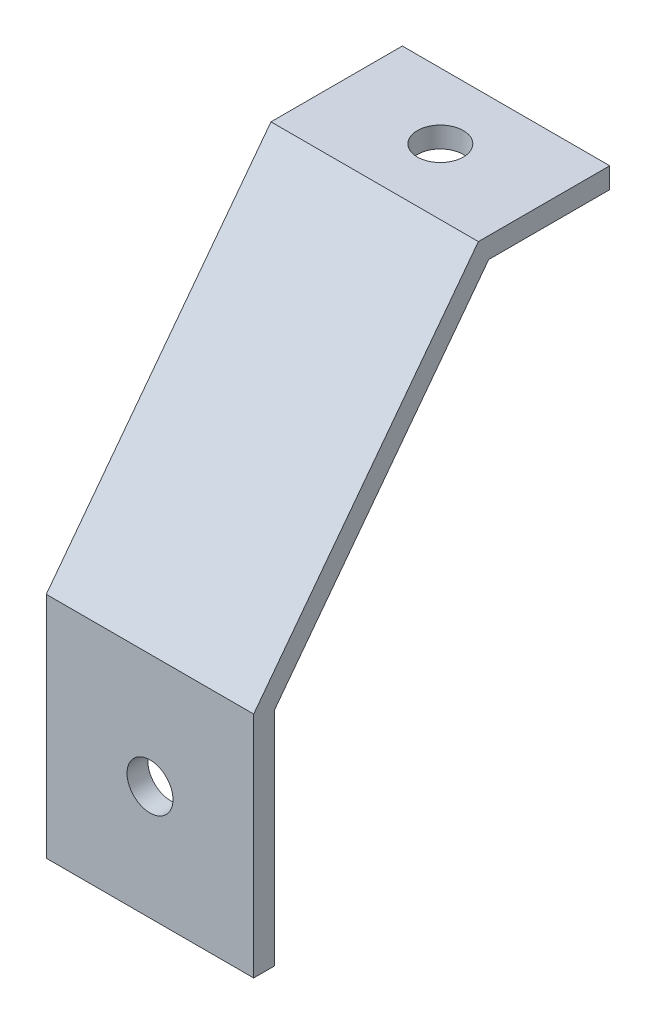
ISO-10303-21;
HEADER;
FILE_DESCRIPTION(('STEP AP214'),'2;1');
FILE_NAME('part.step','',(''),(''),'','','');
FILE_SCHEMA(('AUTOMOTIVE_DESIGN { 1 0 10303 214 1 1 1 1 }'));
ENDSEC;
DATA;
#1=APPLICATION_CONTEXT('core data for automotive mechanical design processes');
#2=APPLICATION_PROTOCOL_DEFINITION('international standard','automotive_design',2000,#1);
#3=PRODUCT_CONTEXT('',#1,'mechanical');
#4=PRODUCT('Part','Part','',(#3));
#5=PRODUCT_RELATED_PRODUCT_CATEGORY('part','',(#4));
#6=PRODUCT_DEFINITION_FORMATION('','',#4);
#7=PRODUCT_DEFINITION_CONTEXT('part definition',#1,'design');
#8=PRODUCT_DEFINITION('design','',#6,#7);
#9=PRODUCT_DEFINITION_SHAPE('','',#8);
#10=(LENGTH_UNIT() NAMED_UNIT(*) SI_UNIT(.MILLI.,.METRE.));
#11=(NAMED_UNIT(*) PLANE_ANGLE_UNIT() SI_UNIT($,.RADIAN.));
#12=(NAMED_UNIT(*) SI_UNIT($,.STERADIAN.) SOLID_ANGLE_UNIT());
#13=UNCERTAINTY_MEASURE_WITH_UNIT(LENGTH_MEASURE(1.E-05),#10,'distance_accuracy_value','');
#14=(GEOMETRIC_REPRESENTATION_CONTEXT(3) GLOBAL_UNCERTAINTY_ASSIGNED_CONTEXT((#13)) GLOBAL_UNIT_ASSIGNED_CONTEXT((#10,
#11,#12)) REPRESENTATION_CONTEXT('',''));
#15=CARTESIAN_POINT('',(0.,0.,0.));
#16=DIRECTION('',(0.,0.,1.));
#17=DIRECTION('',(1.,0.,0.));
#18=AXIS2_PLACEMENT_3D('',#15,#16,#17);
#19=CARTESIAN_POINT('',(0.,68.1228485595605,-32.4549046787092));
#20=DIRECTION('',(1.,0.,0.));
#21=DIRECTION('',(0.,1.,0.));
#22=AXIS2_PLACEMENT_3D('',#19,#20,#21);
#23=PLANE('',#22);
#24=DIRECTION('',(0.,-0.797315565072254,0.603562664264045));
#25=VECTOR('',#24,1.);
#26=CARTESIAN_POINT('',(0.,76.,-32.5));
#27=LINE('',#26,#25);
#28=CARTESIAN_POINT('',(0.,76.,-32.5));
#29=VERTEX_POINT('',#28);
#30=CARTESIAN_POINT('',(0.,33.067,0.));
#31=VERTEX_POINT('',#30);
#32=EDGE_CURVE('E27',#29,#31,#27,.T.);
#33=ORIENTED_EDGE('',*,*,#32,.F.);
#34=DIRECTION('',(0.,0.,1.));
#35=VECTOR('',#34,1.);
#36=CARTESIAN_POINT('',(0.,76.,-51.5));
#37=LINE('',#36,#35);
#38=CARTESIAN_POINT('',(0.,76.,-51.5));
#39=VERTEX_POINT('',#38);
#40=EDGE_CURVE('E149',#39,#29,#37,.T.);
#41=ORIENTED_EDGE('',*,*,#40,.F.);
#42=DIRECTION('',(0.,1.,0.));
#43=VECTOR('',#42,1.);
#44=CARTESIAN_POINT('',(0.,73.,-51.5));
#45=LINE('',#44,#43);
#46=CARTESIAN_POINT('',(0.,73.,-51.5));
#47=VERTEX_POINT('',#46);
#48=EDGE_CURVE('E191',#47,#39,#45,.T.);
#49=ORIENTED_EDGE('',*,*,#48,.F.);
#50=DIRECTION('',(0.,0.,-1.));
#51=VECTOR('',#50,1.);
#52=CARTESIAN_POINT('',(0.,73.,-33.9916452899049));
#53=LINE('',#52,#51);
#54=CARTESIAN_POINT('',(0.,73.,-33.9916452899049));
#55=VERTEX_POINT('',#54);
#56=EDGE_CURVE('E125',#55,#47,#53,.T.);
#57=ORIENTED_EDGE('',*,*,#56,.F.);
#58=DIRECTION('',(0.,0.797315565072254,-0.603562664264045));
#59=VECTOR('',#58,1.);
#60=CARTESIAN_POINT('',(0.,32.1031339039512,-3.03298532853283));
#61=LINE('',#60,#59);
#62=CARTESIAN_POINT('',(0.,32.1031339039512,-3.03298532853283));
#63=VERTEX_POINT('',#62);
#64=EDGE_CURVE('E20',#63,#55,#61,.T.);
#65=ORIENTED_EDGE('',*,*,#64,.F.);
#66=DIRECTION('',(0.,0.999999472142826,-0.00102747947349856));
#67=VECTOR('',#66,1.);
#68=CARTESIAN_POINT('',(0.,0.,-3.));
#69=LINE('',#68,#67);
#70=CARTESIAN_POINT('',(0.,0.,-3.));
#71=VERTEX_POINT('',#70);
#72=EDGE_CURVE('E129',#71,#63,#69,.T.);
#73=ORIENTED_EDGE('',*,*,#72,.F.);
#74=DIRECTION('',(0.,0.,-1.));
#75=VECTOR('',#74,1.);
#76=CARTESIAN_POINT('',(0.,0.,0.));
#77=LINE('',#76,#75);
#78=CARTESIAN_POINT('',(0.,0.,0.));
#79=VERTEX_POINT('',#78);
#80=EDGE_CURVE('E98',#79,#71,#77,.T.);
#81=ORIENTED_EDGE('',*,*,#80,.F.);
#82=DIRECTION('',(0.,-1.,0.));
#83=VECTOR('',#82,1.);
#84=CARTESIAN_POINT('',(0.,33.067,0.));
#85=LINE('',#84,#83);
#86=EDGE_CURVE('E134',#31,#79,#85,.T.);
#87=ORIENTED_EDGE('',*,*,#86,.F.);
#88=EDGE_LOOP('',(#33,#41,#49,#57,#65,#73,#81,#87));
#89=FACE_BOUND('',#88,.T.);
#90=ADVANCED_FACE('F16',(#89),#23,.F.);
#91=CARTESIAN_POINT('',(30.,68.1228485595605,-32.4549046787092));
#92=DIRECTION('',(1.,0.,0.));
#93=DIRECTION('',(0.,1.,0.));
#94=AXIS2_PLACEMENT_3D('',#91,#92,#93);
#95=PLANE('',#94);
#96=DIRECTION('',(0.,-0.797315565072254,0.603562664264045));
#97=VECTOR('',#96,1.);
#98=CARTESIAN_POINT('',(30.,76.,-32.5));
#99=LINE('',#98,#97);
#100=CARTESIAN_POINT('',(30.,76.,-32.5));
#101=VERTEX_POINT('',#100);
#102=CARTESIAN_POINT('',(30.,33.067,0.));
#103=VERTEX_POINT('',#102);
#104=EDGE_CURVE('E11',#101,#103,#99,.T.);
#105=ORIENTED_EDGE('',*,*,#104,.T.);
#106=DIRECTION('',(0.,-1.,0.));
#107=VECTOR('',#106,1.);
#108=CARTESIAN_POINT('',(30.,33.067,0.));
#109=LINE('',#108,#107);
#110=CARTESIAN_POINT('',(30.,0.,0.));
#111=VERTEX_POINT('',#110);
#112=EDGE_CURVE('E130',#103,#111,#109,.T.);
#113=ORIENTED_EDGE('',*,*,#112,.T.);
#114=DIRECTION('',(0.,0.,-1.));
#115=VECTOR('',#114,1.);
#116=CARTESIAN_POINT('',(30.,0.,0.));
#117=LINE('',#116,#115);
#118=CARTESIAN_POINT('',(30.,0.,-3.));
#119=VERTEX_POINT('',#118);
#120=EDGE_CURVE('E152',#111,#119,#117,.T.);
#121=ORIENTED_EDGE('',*,*,#120,.T.);
#122=DIRECTION('',(0.,0.999999472142826,-0.00102747947349856));
#123=VECTOR('',#122,1.);
#124=CARTESIAN_POINT('',(30.,0.,-3.));
#125=LINE('',#124,#123);
#126=CARTESIAN_POINT('',(30.,32.1031339039512,-3.03298532853283));
#127=VERTEX_POINT('',#126);
#128=EDGE_CURVE('E139',#119,#127,#125,.T.);
#129=ORIENTED_EDGE('',*,*,#128,.T.);
#130=DIRECTION('',(0.,0.797315565072254,-0.603562664264045));
#131=VECTOR('',#130,1.);
#132=CARTESIAN_POINT('',(30.,32.1031339039512,-3.03298532853283));
#133=LINE('',#132,#131);
#134=CARTESIAN_POINT('',(30.,73.,-33.9916452899049));
#135=VERTEX_POINT('',#134);
#136=EDGE_CURVE('E41',#127,#135,#133,.T.);
#137=ORIENTED_EDGE('',*,*,#136,.T.);
#138=DIRECTION('',(0.,0.,-1.));
#139=VECTOR('',#138,1.);
#140=CARTESIAN_POINT('',(30.,73.,-33.9916452899049));
#141=LINE('',#140,#139);
#142=CARTESIAN_POINT('',(30.,73.,-51.5));
#143=VERTEX_POINT('',#142);
#144=EDGE_CURVE('E138',#135,#143,#141,.T.);
#145=ORIENTED_EDGE('',*,*,#144,.T.);
#146=DIRECTION('',(0.,1.,0.));
#147=VECTOR('',#146,1.);
#148=CARTESIAN_POINT('',(30.,73.,-51.5));
#149=LINE('',#148,#147);
#150=CARTESIAN_POINT('',(30.,76.,-51.5));
#151=VERTEX_POINT('',#150);
#152=EDGE_CURVE('E164',#143,#151,#149,.T.);
#153=ORIENTED_EDGE('',*,*,#152,.T.);
#154=DIRECTION('',(0.,0.,1.));
#155=VECTOR('',#154,1.);
#156=CARTESIAN_POINT('',(30.,76.,-51.5));
#157=LINE('',#156,#155);
#158=EDGE_CURVE('E148',#151,#101,#157,.T.);
#159=ORIENTED_EDGE('',*,*,#158,.T.);
#160=EDGE_LOOP('',(#105,#113,#121,#129,#137,#145,#153,#159));
#161=FACE_BOUND('',#160,.T.);
#162=ADVANCED_FACE('F237',(#161),#95,.T.);
#163=CARTESIAN_POINT('',(0.,76.,-32.5));
#164=DIRECTION('',(0.,0.603562664264045,0.797315565072254));
#165=DIRECTION('',(1.,0.,0.));
#166=AXIS2_PLACEMENT_3D('',#163,#164,#165);
#167=PLANE('',#166);
#168=ORIENTED_EDGE('',*,*,#32,.T.);
#169=DIRECTION('',(1.,0.,0.));
#170=VECTOR('',#169,1.);
#171=CARTESIAN_POINT('',(0.,33.067,0.));
#172=LINE('',#171,#170);
#173=EDGE_CURVE('E126',#31,#103,#172,.T.);
#174=ORIENTED_EDGE('',*,*,#173,.T.);
#175=ORIENTED_EDGE('',*,*,#104,.F.);
#176=DIRECTION('',(1.,0.,0.));
#177=VECTOR('',#176,1.);
#178=CARTESIAN_POINT('',(0.,76.,-32.5));
#179=LINE('',#178,#177);
#180=EDGE_CURVE('E144',#29,#101,#179,.T.);
#181=ORIENTED_EDGE('',*,*,#180,.F.);
#182=EDGE_LOOP('',(#168,#174,#175,#181));
#183=FACE_BOUND('',#182,.T.);
#184=ADVANCED_FACE('F224',(#183),#167,.T.);
#185=CARTESIAN_POINT('',(0.,52.7228120072079,-18.6419466952168));
#186=DIRECTION('',(0.,-0.603562664264045,-0.797315565072254));
#187=DIRECTION('',(0.,-0.797315565072254,0.603562664264045));
#188=AXIS2_PLACEMENT_3D('',#185,#186,#187);
#189=PLANE('',#188);
#190=ORIENTED_EDGE('',*,*,#64,.T.);
#191=DIRECTION('',(1.,0.,0.));
#192=VECTOR('',#191,1.);
#193=CARTESIAN_POINT('',(0.,73.,-33.9916452899049));
#194=LINE('',#193,#192);
#195=EDGE_CURVE('E135',#55,#135,#194,.T.);
#196=ORIENTED_EDGE('',*,*,#195,.T.);
#197=ORIENTED_EDGE('',*,*,#136,.F.);
#198=DIRECTION('',(1.,0.,0.));
#199=VECTOR('',#198,1.);
#200=CARTESIAN_POINT('',(0.,32.1031339039512,-3.03298532853283));
#201=LINE('',#200,#199);
#202=EDGE_CURVE('E143',#63,#127,#201,.T.);
#203=ORIENTED_EDGE('',*,*,#202,.F.);
#204=EDGE_LOOP('',(#190,#196,#197,#203));
#205=FACE_BOUND('',#204,.T.);
#206=ADVANCED_FACE('F244',(#205),#189,.T.);
#207=CARTESIAN_POINT('',(0.,73.,-33.9916452899049));
#208=DIRECTION('',(0.,-1.,0.));
#209=DIRECTION('',(0.,0.,-1.));
#210=AXIS2_PLACEMENT_3D('',#207,#208,#209);
#211=PLANE('',#210);
#212=ORIENTED_EDGE('',*,*,#56,.T.);
#213=DIRECTION('',(1.,0.,0.));
#214=VECTOR('',#213,1.);
#215=CARTESIAN_POINT('',(0.,73.,-51.5));
#216=LINE('',#215,#214);
#217=EDGE_CURVE('E160',#47,#143,#216,.T.);
#218=ORIENTED_EDGE('',*,*,#217,.T.);
#219=ORIENTED_EDGE('',*,*,#144,.F.);
#220=ORIENTED_EDGE('',*,*,#195,.F.);
#221=EDGE_LOOP('',(#212,#218,#219,#220));
#222=FACE_BOUND('',#221,.T.);
#223=CARTESIAN_POINT('',(15.,73.,-42.));
#224=DIRECTION('',(0.,1.,0.));
#225=DIRECTION('',(-1.,0.,0.));
#226=AXIS2_PLACEMENT_3D('',#223,#224,#225);
#227=CIRCLE('',#226,3.3235);
#228=CARTESIAN_POINT('',(18.3235,73.,-42.));
#229=VERTEX_POINT('',#228);
#230=EDGE_CURVE('E113',#229,#229,#227,.T.);
#231=ORIENTED_EDGE('',*,*,#230,.T.);
#232=EDGE_LOOP('',(#231));
#233=FACE_BOUND('',#232,.T.);
#234=ADVANCED_FACE('F18',(#222,#233),#211,.T.);
#235=CARTESIAN_POINT('',(0.,73.,-51.5));
#236=DIRECTION('',(0.,0.,-1.));
#237=DIRECTION('',(0.,-1.,0.));
#238=AXIS2_PLACEMENT_3D('',#235,#236,#237);
#239=PLANE('',#238);
#240=ORIENTED_EDGE('',*,*,#48,.T.);
#241=DIRECTION('',(1.,0.,0.));
#242=VECTOR('',#241,1.);
#243=CARTESIAN_POINT('',(0.,76.,-51.5));
#244=LINE('',#243,#242);
#245=EDGE_CURVE('E173',#39,#151,#244,.T.);
#246=ORIENTED_EDGE('',*,*,#245,.T.);
#247=ORIENTED_EDGE('',*,*,#152,.F.);
#248=ORIENTED_EDGE('',*,*,#217,.F.);
#249=EDGE_LOOP('',(#240,#246,#247,#248));
#250=FACE_BOUND('',#249,.T.);
#251=ADVANCED_FACE('F206',(#250),#239,.T.);
#252=CARTESIAN_POINT('',(0.,76.,-51.5));
#253=DIRECTION('',(0.,1.,0.));
#254=DIRECTION('',(1.,0.,0.));
#255=AXIS2_PLACEMENT_3D('',#252,#253,#254);
#256=PLANE('',#255);
#257=ORIENTED_EDGE('',*,*,#40,.T.);
#258=ORIENTED_EDGE('',*,*,#180,.T.);
#259=ORIENTED_EDGE('',*,*,#158,.F.);
#260=ORIENTED_EDGE('',*,*,#245,.F.);
#261=EDGE_LOOP('',(#257,#258,#259,#260));
#262=FACE_BOUND('',#261,.T.);
#263=CARTESIAN_POINT('',(15.,76.,-42.));
#264=DIRECTION('',(0.,-1.,0.));
#265=DIRECTION('',(-1.,0.,0.));
#266=AXIS2_PLACEMENT_3D('',#263,#264,#265);
#267=CIRCLE('',#266,3.3235);
#268=CARTESIAN_POINT('',(11.6765,76.,-42.));
#269=VERTEX_POINT('',#268);
#270=EDGE_CURVE('E108',#269,#269,#267,.T.);
#271=ORIENTED_EDGE('',*,*,#270,.T.);
#272=EDGE_LOOP('',(#271));
#273=FACE_BOUND('',#272,.T.);
#274=ADVANCED_FACE('F216',(#262,#273),#256,.T.);
#275=CARTESIAN_POINT('',(0.,0.,0.));
#276=DIRECTION('',(0.,-1.,0.));
#277=DIRECTION('',(0.,0.,-1.));
#278=AXIS2_PLACEMENT_3D('',#275,#276,#277);
#279=PLANE('',#278);
#280=ORIENTED_EDGE('',*,*,#80,.T.);
#281=DIRECTION('',(1.,0.,0.));
#282=VECTOR('',#281,1.);
#283=CARTESIAN_POINT('',(0.,0.,-3.));
#284=LINE('',#283,#282);
#285=EDGE_CURVE('E142',#71,#119,#284,.T.);
#286=ORIENTED_EDGE('',*,*,#285,.T.);
#287=ORIENTED_EDGE('',*,*,#120,.F.);
#288=DIRECTION('',(1.,0.,0.));
#289=VECTOR('',#288,1.);
#290=CARTESIAN_POINT('',(0.,0.,0.));
#291=LINE('',#290,#289);
#292=EDGE_CURVE('E167',#79,#111,#291,.T.);
#293=ORIENTED_EDGE('',*,*,#292,.F.);
#294=EDGE_LOOP('',(#280,#286,#287,#293));
#295=FACE_BOUND('',#294,.T.);
#296=ADVANCED_FACE('F232',(#295),#279,.T.);
#297=CARTESIAN_POINT('',(0.,0.,-3.));
#298=DIRECTION('',(0.,-0.00102747947349856,-0.999999472142826));
#299=DIRECTION('',(0.,-0.999999472142826,0.00102747947349856));
#300=AXIS2_PLACEMENT_3D('',#297,#298,#299);
#301=PLANE('',#300);
#302=ORIENTED_EDGE('',*,*,#72,.T.);
#303=ORIENTED_EDGE('',*,*,#202,.T.);
#304=ORIENTED_EDGE('',*,*,#128,.F.);
#305=ORIENTED_EDGE('',*,*,#285,.F.);
#306=EDGE_LOOP('',(#302,#303,#304,#305));
#307=FACE_BOUND('',#306,.T.);
#308=CARTESIAN_POINT('',(15.,16.5,-3.01695342026171));
#309=DIRECTION('',(0.,0.00102747947349856,0.999999472142826));
#310=DIRECTION('',(0.,0.999999472142826,-0.00102747947349856));
#311=AXIS2_PLACEMENT_3D('',#308,#309,#310);
#312=CIRCLE('',#311,3.32350175433424);
#313=CARTESIAN_POINT('',(15.,13.1765,-3.013538590429));
#314=VERTEX_POINT('',#313);
#315=EDGE_CURVE('E121',#314,#314,#312,.T.);
#316=ORIENTED_EDGE('',*,*,#315,.T.);
#317=EDGE_LOOP('',(#316));
#318=FACE_BOUND('',#317,.T.);
#319=ADVANCED_FACE('F240',(#307,#318),#301,.T.);
#320=CARTESIAN_POINT('',(0.,33.067,0.));
#321=DIRECTION('',(0.,0.,1.));
#322=DIRECTION('',(1.,0.,0.));
#323=AXIS2_PLACEMENT_3D('',#320,#321,#322);
#324=PLANE('',#323);
#325=ORIENTED_EDGE('',*,*,#86,.T.);
#326=ORIENTED_EDGE('',*,*,#292,.T.);
#327=ORIENTED_EDGE('',*,*,#112,.F.);
#328=ORIENTED_EDGE('',*,*,#173,.F.);
#329=EDGE_LOOP('',(#325,#326,#327,#328));
#330=FACE_BOUND('',#329,.T.);
#331=CARTESIAN_POINT('',(15.,16.5,0.));
#332=DIRECTION('',(0.,0.,-1.));
#333=DIRECTION('',(1.,0.,0.));
#334=AXIS2_PLACEMENT_3D('',#331,#332,#333);
#335=CIRCLE('',#334,3.3235);
#336=CARTESIAN_POINT('',(18.3235,16.5,0.));
#337=VERTEX_POINT('',#336);
#338=EDGE_CURVE('E131',#337,#337,#335,.T.);
#339=ORIENTED_EDGE('',*,*,#338,.T.);
#340=EDGE_LOOP('',(#339));
#341=FACE_BOUND('',#340,.T.);
#342=ADVANCED_FACE('F235',(#330,#341),#324,.T.);
#343=CARTESIAN_POINT('',(15.,16.5,-96.5828659752857));
#344=DIRECTION('',(0.,0.,1.));
#345=DIRECTION('',(1.,0.,0.));
#346=AXIS2_PLACEMENT_3D('',#343,#344,#345);
#347=CYLINDRICAL_SURFACE('',#346,3.3235);
#348=ORIENTED_EDGE('',*,*,#338,.F.);
#349=EDGE_LOOP('',(#348));
#350=FACE_BOUND('',#349,.T.);
#351=ORIENTED_EDGE('',*,*,#315,.F.);
#352=EDGE_LOOP('',(#351));
#353=FACE_BOUND('',#352,.T.);
#354=ADVANCED_FACE('F291',(#350,#353),#347,.F.);
#355=CARTESIAN_POINT('',(15.,-20.5828659752857,-42.));
#356=DIRECTION('',(0.,1.,0.));
#357=DIRECTION('',(-1.,0.,0.));
#358=AXIS2_PLACEMENT_3D('',#355,#356,#357);
#359=CYLINDRICAL_SURFACE('',#358,3.3235);
#360=ORIENTED_EDGE('',*,*,#270,.F.);
#361=EDGE_LOOP('',(#360));
#362=FACE_BOUND('',#361,.T.);
#363=ORIENTED_EDGE('',*,*,#230,.F.);
#364=EDGE_LOOP('',(#363));
#365=FACE_BOUND('',#364,.T.);
#366=ADVANCED_FACE('F286',(#362,#365),#359,.F.);
#367=CLOSED_SHELL('',(#90,#162,#184,#206,#234,#251,#274,#296,#319,#342,#354,#366));
#368=MANIFOLD_SOLID_BREP('B1',#367);
#369=ADVANCED_BREP_SHAPE_REPRESENTATION('',(#18,#368),#14);
#370=SHAPE_DEFINITION_REPRESENTATION(#9,#369);
ENDSEC;
END-ISO-10303-21;
